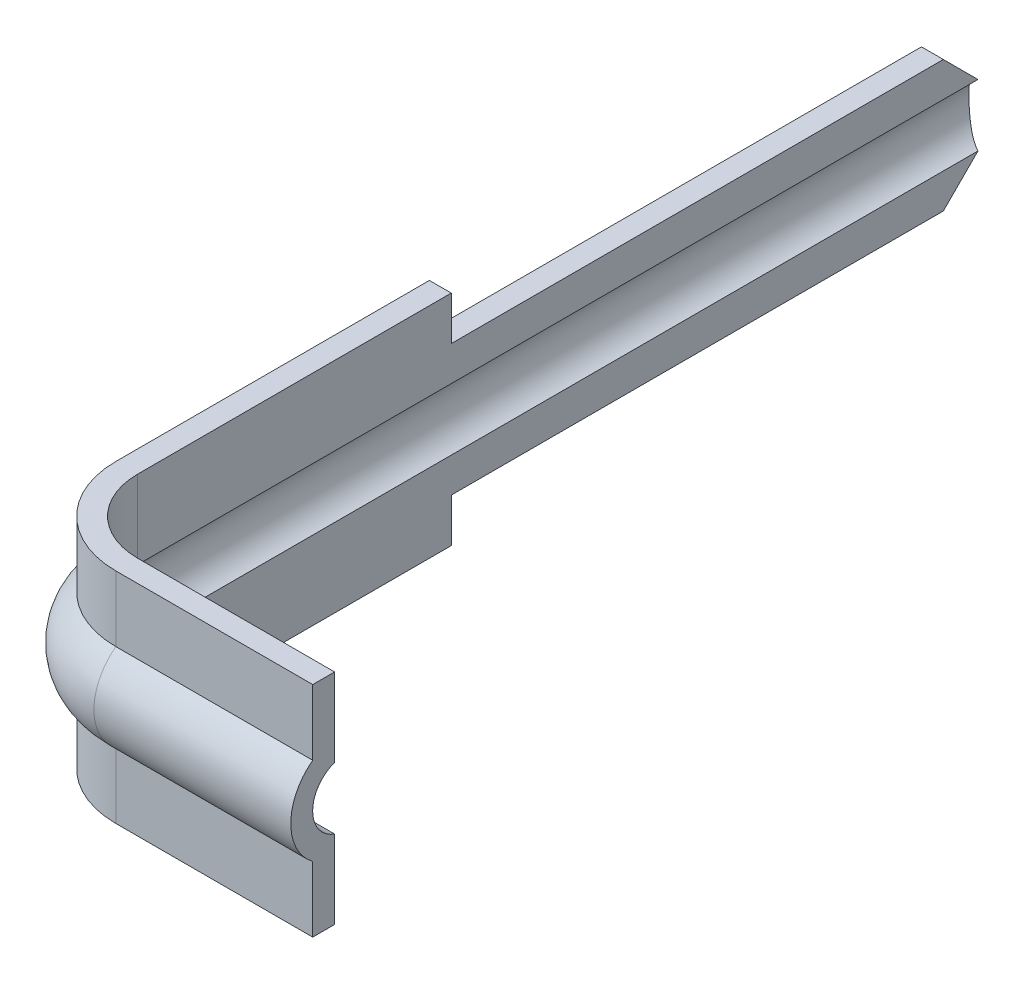
ISO-10303-21;
HEADER;
FILE_DESCRIPTION(('STEP AP214'),'2;1');
FILE_NAME('part.step','',(''),(''),'','','');
FILE_SCHEMA(('AUTOMOTIVE_DESIGN { 1 0 10303 214 1 1 1 1 }'));
ENDSEC;
DATA;
#1=APPLICATION_CONTEXT('core data for automotive mechanical design processes');
#2=APPLICATION_PROTOCOL_DEFINITION('international standard','automotive_design',2000,#1);
#3=PRODUCT_CONTEXT('',#1,'mechanical');
#4=PRODUCT('Part','Part','',(#3));
#5=PRODUCT_RELATED_PRODUCT_CATEGORY('part','',(#4));
#6=PRODUCT_DEFINITION_FORMATION('','',#4);
#7=PRODUCT_DEFINITION_CONTEXT('part definition',#1,'design');
#8=PRODUCT_DEFINITION('design','',#6,#7);
#9=PRODUCT_DEFINITION_SHAPE('','',#8);
#10=(LENGTH_UNIT() NAMED_UNIT(*) SI_UNIT(.MILLI.,.METRE.));
#11=(NAMED_UNIT(*) PLANE_ANGLE_UNIT() SI_UNIT($,.RADIAN.));
#12=(NAMED_UNIT(*) SI_UNIT($,.STERADIAN.) SOLID_ANGLE_UNIT());
#13=UNCERTAINTY_MEASURE_WITH_UNIT(LENGTH_MEASURE(1.E-05),#10,'distance_accuracy_value','');
#14=(GEOMETRIC_REPRESENTATION_CONTEXT(3) GLOBAL_UNCERTAINTY_ASSIGNED_CONTEXT((#13)) GLOBAL_UNIT_ASSIGNED_CONTEXT((#10,
#11,#12)) REPRESENTATION_CONTEXT('',''));
#15=CARTESIAN_POINT('',(0.,0.,0.));
#16=DIRECTION('',(0.,0.,1.));
#17=DIRECTION('',(1.,0.,0.));
#18=AXIS2_PLACEMENT_3D('',#15,#16,#17);
#19=CARTESIAN_POINT('',(0.65,0.,6.399749095762));
#20=DIRECTION('',(1.,0.,0.));
#21=DIRECTION('',(0.,0.,-1.));
#22=AXIS2_PLACEMENT_3D('',#19,#20,#21);
#23=CYLINDRICAL_SURFACE('',#22,0.375);
#24=DIRECTION('',(1.,0.,0.));
#25=VECTOR('',#24,1.);
#26=CARTESIAN_POINT('',(0.65,-0.300363239545,6.624263960147));
#27=LINE('',#26,#25);
#28=CARTESIAN_POINT('',(2.,-0.300363239545206,6.624263960147));
#29=VERTEX_POINT('',#28);
#30=CARTESIAN_POINT('',(0.65,-0.300363239545066,6.62426396014705));
#31=VERTEX_POINT('',#30);
#32=EDGE_CURVE('E137',#29,#31,#27,.F.);
#33=ORIENTED_EDGE('',*,*,#32,.F.);
#34=CARTESIAN_POINT('',(2.,0.,6.399749095762));
#35=DIRECTION('',(1.,0.,0.));
#36=DIRECTION('',(0.,0.,-1.));
#37=AXIS2_PLACEMENT_3D('',#34,#35,#36);
#38=CIRCLE('',#37,0.375);
#39=CARTESIAN_POINT('',(2.,0.300363239545158,6.624263960147));
#40=VERTEX_POINT('',#39);
#41=EDGE_CURVE('E21',#29,#40,#38,.F.);
#42=ORIENTED_EDGE('',*,*,#41,.T.);
#43=DIRECTION('',(1.,0.,0.));
#44=VECTOR('',#43,1.);
#45=CARTESIAN_POINT('',(0.65,0.300363239545,6.624263960147));
#46=LINE('',#45,#44);
#47=CARTESIAN_POINT('',(0.65,0.300363239545051,6.62426396014704));
#48=VERTEX_POINT('',#47);
#49=EDGE_CURVE('E139',#48,#40,#46,.T.);
#50=ORIENTED_EDGE('',*,*,#49,.F.);
#51=CARTESIAN_POINT('',(0.65,0.,6.399749095762));
#52=DIRECTION('',(1.,0.,0.));
#53=DIRECTION('',(0.,0.,-1.));
#54=AXIS2_PLACEMENT_3D('',#51,#52,#53);
#55=CIRCLE('',#54,0.375);
#56=EDGE_CURVE('E134',#48,#31,#55,.T.);
#57=ORIENTED_EDGE('',*,*,#56,.T.);
#58=EDGE_LOOP('',(#33,#42,#50,#57));
#59=FACE_BOUND('',#58,.T.);
#60=ADVANCED_FACE('F17',(#59),#23,.T.);
#61=CARTESIAN_POINT('',(0.650000000000002,0.,5.974263960147));
#62=DIRECTION('',(0.,1.,0.));
#63=DIRECTION('',(0.,0.,1.));
#64=AXIS2_PLACEMENT_3D('',#61,#62,#63);
#65=TOROIDAL_SURFACE('',#64,0.425485135615345,0.224999999999753);
#66=CARTESIAN_POINT('',(0.65,-0.21230293351,5.974263960147));
#67=DIRECTION('',(0.,1.,0.));
#68=DIRECTION('',(0.,0.,1.));
#69=AXIS2_PLACEMENT_3D('',#66,#67,#68);
#70=CIRCLE('',#69,0.499999996033);
#71=CARTESIAN_POINT('',(0.65,-0.212302933509976,6.47426395617999));
#72=VERTEX_POINT('',#71);
#73=CARTESIAN_POINT('',(0.15000000260008,-0.212302934478904,5.974263960147));
#74=VERTEX_POINT('',#73);
#75=EDGE_CURVE('E159',#72,#74,#70,.F.);
#76=ORIENTED_EDGE('',*,*,#75,.T.);
#77=CARTESIAN_POINT('',(0.224514864384999,0.,5.974263960147));
#78=DIRECTION('',(0.,0.,1.));
#79=DIRECTION('',(1.,0.,0.));
#80=AXIS2_PLACEMENT_3D('',#77,#78,#79);
#81=CIRCLE('',#80,0.225);
#82=CARTESIAN_POINT('',(0.149999999999682,0.212302932117223,5.974263960147));
#83=VERTEX_POINT('',#82);
#84=EDGE_CURVE('E193',#74,#83,#81,.F.);
#85=ORIENTED_EDGE('',*,*,#84,.T.);
#86=CARTESIAN_POINT('',(0.65,0.212302932117,5.974263960147));
#87=DIRECTION('',(0.,1.,0.));
#88=DIRECTION('',(0.,0.,1.));
#89=AXIS2_PLACEMENT_3D('',#86,#87,#88);
#90=CIRCLE('',#89,0.5);
#91=CARTESIAN_POINT('',(0.65,0.212302932117099,6.47426396014703));
#92=VERTEX_POINT('',#91);
#93=EDGE_CURVE('E198',#83,#92,#90,.T.);
#94=ORIENTED_EDGE('',*,*,#93,.T.);
#95=CARTESIAN_POINT('',(0.65,0.,6.399749095762));
#96=DIRECTION('',(1.,0.,0.));
#97=DIRECTION('',(0.,0.,-1.));
#98=AXIS2_PLACEMENT_3D('',#95,#96,#97);
#99=CIRCLE('',#98,0.225);
#100=EDGE_CURVE('E186',#92,#72,#99,.T.);
#101=ORIENTED_EDGE('',*,*,#100,.T.);
#102=EDGE_LOOP('',(#76,#85,#94,#101));
#103=FACE_BOUND('',#102,.T.);
#104=ADVANCED_FACE('F475',(#103),#65,.F.);
#105=CARTESIAN_POINT('',(0.65,0.,6.399749095762));
#106=DIRECTION('',(1.,0.,0.));
#107=DIRECTION('',(0.,0.,-1.));
#108=AXIS2_PLACEMENT_3D('',#105,#106,#107);
#109=CYLINDRICAL_SURFACE('',#108,0.225);
#110=DIRECTION('',(-1.,0.,0.));
#111=VECTOR('',#110,1.);
#112=CARTESIAN_POINT('',(0.65,-0.21230293351,6.47426395618));
#113=LINE('',#112,#111);
#114=CARTESIAN_POINT('',(2.,-0.212302933509947,6.47426395618));
#115=VERTEX_POINT('',#114);
#116=EDGE_CURVE('E179',#72,#115,#113,.F.);
#117=ORIENTED_EDGE('',*,*,#116,.F.);
#118=ORIENTED_EDGE('',*,*,#100,.F.);
#119=DIRECTION('',(-1.,0.,0.));
#120=VECTOR('',#119,1.);
#121=CARTESIAN_POINT('',(0.65,0.212302932117,6.474263960147));
#122=LINE('',#121,#120);
#123=CARTESIAN_POINT('',(2.,0.212302932117223,6.474263960147));
#124=VERTEX_POINT('',#123);
#125=EDGE_CURVE('E195',#124,#92,#122,.T.);
#126=ORIENTED_EDGE('',*,*,#125,.F.);
#127=CARTESIAN_POINT('',(2.,0.,6.399749095762));
#128=DIRECTION('',(1.,0.,0.));
#129=DIRECTION('',(0.,0.,-1.));
#130=AXIS2_PLACEMENT_3D('',#127,#128,#129);
#131=CIRCLE('',#130,0.225);
#132=EDGE_CURVE('E188',#115,#124,#131,.F.);
#133=ORIENTED_EDGE('',*,*,#132,.F.);
#134=EDGE_LOOP('',(#117,#118,#126,#133));
#135=FACE_BOUND('',#134,.T.);
#136=ADVANCED_FACE('F470',(#135),#109,.F.);
#137=CARTESIAN_POINT('',(0.224514864385,0.,0.));
#138=DIRECTION('',(0.,0.,1.));
#139=DIRECTION('',(1.,0.,0.));
#140=AXIS2_PLACEMENT_3D('',#137,#138,#139);
#141=CYLINDRICAL_SURFACE('',#140,0.225);
#142=ORIENTED_EDGE('',*,*,#84,.F.);
#143=DIRECTION('',(0.,0.,1.));
#144=VECTOR('',#143,1.);
#145=CARTESIAN_POINT('',(0.15000000123301,-0.212302935447808,0.212217486093047));
#146=LINE('',#145,#144);
#147=CARTESIAN_POINT('',(0.149878706829823,-0.212217516437203,0.212217486093047));
#148=VERTEX_POINT('',#147);
#149=EDGE_CURVE('E392',#148,#74,#146,.T.);
#150=ORIENTED_EDGE('',*,*,#149,.F.);
#151=CARTESIAN_POINT('',(0.149854531057934,0.212251818902621,0.212251886558882));
#152=CARTESIAN_POINT('',(0.137009872833372,0.207705948526972,0.207680473895742));
#153=CARTESIAN_POINT('',(0.124839235359186,0.20214062642089,0.202417834791372));
#154=CARTESIAN_POINT('',(0.101858196558429,0.189098899184247,0.191212930079771));
#155=CARTESIAN_POINT('',(0.0910513324542329,0.181617670906104,0.185268970473873));
#156=CARTESIAN_POINT('',(0.0709116779501815,0.164926276219742,0.173455854395994));
#157=CARTESIAN_POINT('',(0.0615737792867725,0.155722356485768,0.167586507013828));
#158=CARTESIAN_POINT('',(0.0445066488330214,0.135629283834086,0.156428309511392));
#159=CARTESIAN_POINT('',(0.0367748848776444,0.124742831525081,0.15113855195332));
#160=CARTESIAN_POINT('',(0.0245888606867424,0.103779791506947,0.142606903498528));
#161=CARTESIAN_POINT('',(0.019787953314767,0.0939856996557297,0.13916723484887));
#162=CARTESIAN_POINT('',(0.0115939740804189,0.0735562783870995,0.133227509892223));
#163=CARTESIAN_POINT('',(0.00819979692309744,0.0629216172745249,0.130726716039307));
#164=CARTESIAN_POINT('',(0.00299194705349419,0.0409913393325027,0.126868175821447));
#165=CARTESIAN_POINT('',(0.00118848377505597,0.0296919424761923,0.12551781496205));
#166=CARTESIAN_POINT('',(-0.000670971779713009,0.00687021780712604,0.12412535134443));
#167=CARTESIAN_POINT('',(-0.000727653770083491,-0.00465202021885717,0.124082732226319));
#168=CARTESIAN_POINT('',(0.000821695307690322,-0.0263015087161359,0.125243240037184));
#169=CARTESIAN_POINT('',(0.00225498435335123,-0.0364489499031219,0.12631694598688));
#170=CARTESIAN_POINT('',(0.00643922332999268,-0.0563121889376492,0.129425082353867));
#171=CARTESIAN_POINT('',(0.00919027079931914,-0.0660279547750986,0.131459583887535));
#172=CARTESIAN_POINT('',(0.0159780558423754,-0.0851064544130938,0.13641505698033));
#173=CARTESIAN_POINT('',(0.0200513306223396,-0.0944494816443028,0.139361093364397));
#174=CARTESIAN_POINT('',(0.0292957223225264,-0.112320339203326,0.145920879918083));
#175=CARTESIAN_POINT('',(0.0344674997572095,-0.120847674572672,0.149535031645922));
#176=CARTESIAN_POINT('',(0.046702211971752,-0.138346635000022,0.157864223749857));
#177=CARTESIAN_POINT('',(0.0539364513548188,-0.147158562953652,0.162662482201177));
#178=CARTESIAN_POINT('',(0.0695411380838534,-0.163511365804319,0.172558538969062));
#179=CARTESIAN_POINT('',(0.0779120996840653,-0.171051661932379,0.177656472263404));
#180=CARTESIAN_POINT('',(0.0961703590875287,-0.185184776837844,0.188071793329845));
#181=CARTESIAN_POINT('',(0.106114068995095,-0.191707404838909,0.193386711928983));
#182=CARTESIAN_POINT('',(0.127138437883396,-0.203185226595241,0.203411628211903));
#183=CARTESIAN_POINT('',(0.138219139192974,-0.208140361966553,0.208121603359648));
#184=CARTESIAN_POINT('',(0.149854533802602,-0.212251819868164,0.212251887567013));
#185=B_SPLINE_CURVE_WITH_KNOTS('',3,(#151,#152,#153,#154,#155,#156,#157,#158,#159,#160,#161,
#162,#163,#164,#165,#166,#167,#168,#169,#170,#171,#172,#173,#174,#175,#176,#177,#178,#179,#180,
#181,#182,#183,#184),.UNSPECIFIED.,.F.,.F.,(4,2,2,2,2,2,2,2,2,2,2,2,2,2,2,2,4),(0.,
0.0429654000817238,0.0860400441416619,0.128961418834472,0.171814603128912,0.205989054978089,
0.240136604164766,0.27450175515878,0.308853336949201,0.339623345820457,0.370395632589994,
0.4021032492694,0.433829985546777,0.47080297466866,0.507792746481156,0.546717356360889,
0.585643415883894),.UNSPECIFIED.);
#186=CARTESIAN_POINT('',(0.149878703882219,0.212217513609271,0.212217487525755));
#187=VERTEX_POINT('',#186);
#188=EDGE_CURVE('E121',#187,#148,#185,.T.);
#189=ORIENTED_EDGE('',*,*,#188,.F.);
#190=DIRECTION('',(0.,0.,1.));
#191=VECTOR('',#190,1.);
#192=CARTESIAN_POINT('',(0.149999999999999,0.212302932117445,5.974263960147));
#193=LINE('',#192,#191);
#194=EDGE_CURVE('E171',#83,#187,#193,.F.);
#195=ORIENTED_EDGE('',*,*,#194,.F.);
#196=EDGE_LOOP('',(#142,#150,#189,#195));
#197=FACE_BOUND('',#196,.T.);
#198=ADVANCED_FACE('F464',(#197),#141,.F.);
#199=CARTESIAN_POINT('',(0.65,0.212302932117,6.474263960147));
#200=DIRECTION('',(0.,0.,-1.));
#201=DIRECTION('',(-1.,0.,0.));
#202=AXIS2_PLACEMENT_3D('',#199,#200,#201);
#203=PLANE('',#202);
#204=DIRECTION('',(1.,0.,0.));
#205=VECTOR('',#204,1.);
#206=CARTESIAN_POINT('',(0.15,0.75,6.474263960147));
#207=LINE('',#206,#205);
#208=CARTESIAN_POINT('',(2.,0.75,6.474263960147));
#209=VERTEX_POINT('',#208);
#210=CARTESIAN_POINT('',(0.65,0.75,6.474263960147));
#211=VERTEX_POINT('',#210);
#212=EDGE_CURVE('E351',#209,#211,#207,.F.);
#213=ORIENTED_EDGE('',*,*,#212,.F.);
#214=DIRECTION('',(0.,1.,0.));
#215=VECTOR('',#214,1.);
#216=CARTESIAN_POINT('',(2.,0.,6.474263960147));
#217=LINE('',#216,#215);
#218=EDGE_CURVE('E361',#209,#124,#217,.F.);
#219=ORIENTED_EDGE('',*,*,#218,.T.);
#220=ORIENTED_EDGE('',*,*,#125,.T.);
#221=DIRECTION('',(0.,1.,0.));
#222=VECTOR('',#221,1.);
#223=CARTESIAN_POINT('',(0.65,0.,6.474263960147));
#224=LINE('',#223,#222);
#225=EDGE_CURVE('E201',#92,#211,#224,.T.);
#226=ORIENTED_EDGE('',*,*,#225,.T.);
#227=EDGE_LOOP('',(#213,#219,#220,#226));
#228=FACE_BOUND('',#227,.T.);
#229=ADVANCED_FACE('F469',(#228),#203,.T.);
#230=CARTESIAN_POINT('',(0.65,0.,5.974263960147));
#231=DIRECTION('',(0.,1.,0.));
#232=DIRECTION('',(0.,0.,1.));
#233=AXIS2_PLACEMENT_3D('',#230,#231,#232);
#234=CYLINDRICAL_SURFACE('',#233,0.5);
#235=ORIENTED_EDGE('',*,*,#93,.F.);
#236=DIRECTION('',(0.,1.,0.));
#237=VECTOR('',#236,1.);
#238=CARTESIAN_POINT('',(0.149999999999999,0.212302932117,5.974263960147));
#239=LINE('',#238,#237);
#240=CARTESIAN_POINT('',(0.149999999999999,0.75,5.974263960147));
#241=VERTEX_POINT('',#240);
#242=EDGE_CURVE('E412',#241,#83,#239,.F.);
#243=ORIENTED_EDGE('',*,*,#242,.F.);
#244=CARTESIAN_POINT('',(0.65,0.75,5.974263960147));
#245=DIRECTION('',(0.,1.,0.));
#246=DIRECTION('',(0.,0.,1.));
#247=AXIS2_PLACEMENT_3D('',#244,#245,#246);
#248=CIRCLE('',#247,0.5);
#249=EDGE_CURVE('E348',#211,#241,#248,.F.);
#250=ORIENTED_EDGE('',*,*,#249,.F.);
#251=ORIENTED_EDGE('',*,*,#225,.F.);
#252=EDGE_LOOP('',(#235,#243,#250,#251));
#253=FACE_BOUND('',#252,.T.);
#254=ADVANCED_FACE('F540',(#253),#234,.F.);
#255=CARTESIAN_POINT('',(0.65,0.75,6.624263960147));
#256=DIRECTION('',(0.,0.,1.));
#257=DIRECTION('',(1.,0.,0.));
#258=AXIS2_PLACEMENT_3D('',#255,#256,#257);
#259=PLANE('',#258);
#260=ORIENTED_EDGE('',*,*,#49,.T.);
#261=DIRECTION('',(0.,1.,0.));
#262=VECTOR('',#261,1.);
#263=CARTESIAN_POINT('',(2.,0.,6.624263960147));
#264=LINE('',#263,#262);
#265=CARTESIAN_POINT('',(2.,0.75,6.624263960147));
#266=VERTEX_POINT('',#265);
#267=EDGE_CURVE('E370',#40,#266,#264,.T.);
#268=ORIENTED_EDGE('',*,*,#267,.T.);
#269=DIRECTION('',(1.,0.,0.));
#270=VECTOR('',#269,1.);
#271=CARTESIAN_POINT('',(0.15,0.75,6.624263960147));
#272=LINE('',#271,#270);
#273=CARTESIAN_POINT('',(0.65,0.75,6.624263960147));
#274=VERTEX_POINT('',#273);
#275=EDGE_CURVE('E340',#274,#266,#272,.T.);
#276=ORIENTED_EDGE('',*,*,#275,.F.);
#277=DIRECTION('',(0.,1.,0.));
#278=VECTOR('',#277,1.);
#279=CARTESIAN_POINT('',(0.65,0.75,6.624263960147));
#280=LINE('',#279,#278);
#281=EDGE_CURVE('E404',#274,#48,#280,.F.);
#282=ORIENTED_EDGE('',*,*,#281,.T.);
#283=EDGE_LOOP('',(#260,#268,#276,#282));
#284=FACE_BOUND('',#283,.T.);
#285=ADVANCED_FACE('F426',(#284),#259,.T.);
#286=CARTESIAN_POINT('',(0.15,0.212302932117,0.));
#287=DIRECTION('',(1.,0.,0.));
#288=DIRECTION('',(0.,0.,-1.));
#289=AXIS2_PLACEMENT_3D('',#286,#287,#288);
#290=PLANE('',#289);
#291=DIRECTION('',(0.,0.,1.));
#292=VECTOR('',#291,1.);
#293=CARTESIAN_POINT('',(0.149999999848,0.450000000021,3.824264353828));
#294=LINE('',#293,#292);
#295=CARTESIAN_POINT('',(0.149999999873333,0.450000000021,3.824264353828));
#296=VERTEX_POINT('',#295);
#297=CARTESIAN_POINT('',(0.149999999924,0.450000000021,0.45));
#298=VERTEX_POINT('',#297);
#299=EDGE_CURVE('E321',#296,#298,#294,.F.);
#300=ORIENTED_EDGE('',*,*,#299,.F.);
#301=DIRECTION('',(0.,1.,0.));
#302=VECTOR('',#301,1.);
#303=CARTESIAN_POINT('',(0.149999999924,1.074371982483,3.824264353828));
#304=LINE('',#303,#302);
#305=CARTESIAN_POINT('',(0.149999999949333,0.75,3.824264353828));
#306=VERTEX_POINT('',#305);
#307=EDGE_CURVE('E327',#306,#296,#304,.F.);
#308=ORIENTED_EDGE('',*,*,#307,.F.);
#309=DIRECTION('',(0.,0.,1.));
#310=VECTOR('',#309,1.);
#311=CARTESIAN_POINT('',(0.15,0.75,0.));
#312=LINE('',#311,#310);
#313=EDGE_CURVE('E343',#241,#306,#312,.F.);
#314=ORIENTED_EDGE('',*,*,#313,.F.);
#315=ORIENTED_EDGE('',*,*,#242,.T.);
#316=ORIENTED_EDGE('',*,*,#194,.T.);
#317=DIRECTION('',(0.,0.707106781186547,0.707106781186548));
#318=VECTOR('',#317,1.);
#319=CARTESIAN_POINT('',(0.15,0.212217483247,0.212217483226));
#320=LINE('',#319,#318);
#321=EDGE_CURVE('E169',#187,#298,#320,.T.);
#322=ORIENTED_EDGE('',*,*,#321,.T.);
#323=EDGE_LOOP('',(#300,#308,#314,#315,#316,#322));
#324=FACE_BOUND('',#323,.T.);
#325=ADVANCED_FACE('F543',(#324),#290,.T.);
#326=CARTESIAN_POINT('',(0.65,-0.300363239545,6.624263960147));
#327=DIRECTION('',(0.,0.,1.));
#328=DIRECTION('',(1.,0.,0.));
#329=AXIS2_PLACEMENT_3D('',#326,#327,#328);
#330=PLANE('',#329);
#331=DIRECTION('',(1.,0.,0.));
#332=VECTOR('',#331,1.);
#333=CARTESIAN_POINT('',(0.,-0.75,6.624263960147));
#334=LINE('',#333,#332);
#335=CARTESIAN_POINT('',(2.,-0.75,6.624263960147));
#336=VERTEX_POINT('',#335);
#337=CARTESIAN_POINT('',(0.65,-0.75,6.624263960147));
#338=VERTEX_POINT('',#337);
#339=EDGE_CURVE('E288',#336,#338,#334,.F.);
#340=ORIENTED_EDGE('',*,*,#339,.F.);
#341=DIRECTION('',(0.,1.,0.));
#342=VECTOR('',#341,1.);
#343=CARTESIAN_POINT('',(2.,0.,6.624263960147));
#344=LINE('',#343,#342);
#345=EDGE_CURVE('E168',#336,#29,#344,.T.);
#346=ORIENTED_EDGE('',*,*,#345,.T.);
#347=ORIENTED_EDGE('',*,*,#32,.T.);
#348=DIRECTION('',(0.,1.,0.));
#349=VECTOR('',#348,1.);
#350=CARTESIAN_POINT('',(0.65,-0.300363239545,6.624263960147));
#351=LINE('',#350,#349);
#352=EDGE_CURVE('E149',#31,#338,#351,.F.);
#353=ORIENTED_EDGE('',*,*,#352,.T.);
#354=EDGE_LOOP('',(#340,#346,#347,#353));
#355=FACE_BOUND('',#354,.T.);
#356=ADVANCED_FACE('F167',(#355),#330,.T.);
#357=CARTESIAN_POINT('',(0.65,0.,5.974263960147));
#358=DIRECTION('',(0.,1.,0.));
#359=DIRECTION('',(0.,0.,1.));
#360=AXIS2_PLACEMENT_3D('',#357,#358,#359);
#361=CYLINDRICAL_SURFACE('',#360,0.499999996033);
#362=DIRECTION('',(0.,1.,0.));
#363=VECTOR('',#362,1.);
#364=CARTESIAN_POINT('',(0.150000003966999,-0.75,5.974263960147));
#365=LINE('',#364,#363);
#366=CARTESIAN_POINT('',(0.150000003852999,-0.75,5.974263960147));
#367=VERTEX_POINT('',#366);
#368=EDGE_CURVE('E354',#74,#367,#365,.F.);
#369=ORIENTED_EDGE('',*,*,#368,.F.);
#370=ORIENTED_EDGE('',*,*,#75,.F.);
#371=DIRECTION('',(0.,1.,0.));
#372=VECTOR('',#371,1.);
#373=CARTESIAN_POINT('',(0.65,-0.75,6.47426395618));
#374=LINE('',#373,#372);
#375=CARTESIAN_POINT('',(0.65,-0.75,6.47426395618));
#376=VERTEX_POINT('',#375);
#377=EDGE_CURVE('E183',#376,#72,#374,.T.);
#378=ORIENTED_EDGE('',*,*,#377,.F.);
#379=CARTESIAN_POINT('',(0.65,-0.75,5.974263960147));
#380=DIRECTION('',(0.,1.,0.));
#381=DIRECTION('',(0.,0.,1.));
#382=AXIS2_PLACEMENT_3D('',#379,#380,#381);
#383=CIRCLE('',#382,0.499999996033);
#384=EDGE_CURVE('E282',#367,#376,#383,.T.);
#385=ORIENTED_EDGE('',*,*,#384,.F.);
#386=EDGE_LOOP('',(#369,#370,#378,#385));
#387=FACE_BOUND('',#386,.T.);
#388=ADVANCED_FACE('F576',(#387),#361,.F.);
#389=CARTESIAN_POINT('',(0.65,-0.75,6.47426395618));
#390=DIRECTION('',(0.,0.,-1.));
#391=DIRECTION('',(-1.,0.,0.));
#392=AXIS2_PLACEMENT_3D('',#389,#390,#391);
#393=PLANE('',#392);
#394=DIRECTION('',(0.,1.,0.));
#395=VECTOR('',#394,1.);
#396=CARTESIAN_POINT('',(2.,0.,6.47426395618));
#397=LINE('',#396,#395);
#398=CARTESIAN_POINT('',(2.,-0.75,6.47426395618));
#399=VERTEX_POINT('',#398);
#400=EDGE_CURVE('E182',#115,#399,#397,.F.);
#401=ORIENTED_EDGE('',*,*,#400,.T.);
#402=DIRECTION('',(1.,0.,0.));
#403=VECTOR('',#402,1.);
#404=CARTESIAN_POINT('',(0.,-0.75,6.47426395618));
#405=LINE('',#404,#403);
#406=EDGE_CURVE('E278',#376,#399,#405,.T.);
#407=ORIENTED_EDGE('',*,*,#406,.F.);
#408=ORIENTED_EDGE('',*,*,#377,.T.);
#409=ORIENTED_EDGE('',*,*,#116,.T.);
#410=EDGE_LOOP('',(#401,#407,#408,#409));
#411=FACE_BOUND('',#410,.T.);
#412=ADVANCED_FACE('F530',(#411),#393,.T.);
#413=CARTESIAN_POINT('',(2.,0.,6.399749095762));
#414=DIRECTION('',(-1.,0.,0.));
#415=DIRECTION('',(0.,0.,1.));
#416=AXIS2_PLACEMENT_3D('',#413,#414,#415);
#417=PLANE('',#416);
#418=DIRECTION('',(0.,0.,1.));
#419=VECTOR('',#418,1.);
#420=CARTESIAN_POINT('',(2.,0.75,0.));
#421=LINE('',#420,#419);
#422=EDGE_CURVE('E337',#266,#209,#421,.F.);
#423=ORIENTED_EDGE('',*,*,#422,.F.);
#424=ORIENTED_EDGE('',*,*,#267,.F.);
#425=ORIENTED_EDGE('',*,*,#41,.F.);
#426=ORIENTED_EDGE('',*,*,#345,.F.);
#427=DIRECTION('',(0.,0.,-1.));
#428=VECTOR('',#427,1.);
#429=CARTESIAN_POINT('',(2.,-0.75,0.));
#430=LINE('',#429,#428);
#431=EDGE_CURVE('E281',#399,#336,#430,.F.);
#432=ORIENTED_EDGE('',*,*,#431,.F.);
#433=ORIENTED_EDGE('',*,*,#400,.F.);
#434=ORIENTED_EDGE('',*,*,#132,.T.);
#435=ORIENTED_EDGE('',*,*,#218,.F.);
#436=EDGE_LOOP('',(#423,#424,#425,#426,#432,#433,#434,#435));
#437=FACE_BOUND('',#436,.T.);
#438=ADVANCED_FACE('F429',(#437),#417,.F.);
#439=CARTESIAN_POINT('',(0.150000003967,-0.75,0.));
#440=DIRECTION('',(1.,0.,0.));
#441=DIRECTION('',(0.,0.,-1.));
#442=AXIS2_PLACEMENT_3D('',#439,#440,#441);
#443=PLANE('',#442);
#444=ORIENTED_EDGE('',*,*,#149,.T.);
#445=ORIENTED_EDGE('',*,*,#368,.T.);
#446=DIRECTION('',(0.,0.,-1.));
#447=VECTOR('',#446,1.);
#448=CARTESIAN_POINT('',(0.150000003739,-0.75,0.));
#449=LINE('',#448,#447);
#450=CARTESIAN_POINT('',(0.150000003827666,-0.75,3.824264353828));
#451=VERTEX_POINT('',#450);
#452=EDGE_CURVE('E285',#451,#367,#449,.F.);
#453=ORIENTED_EDGE('',*,*,#452,.F.);
#454=DIRECTION('',(0.,1.,0.));
#455=VECTOR('',#454,1.);
#456=CARTESIAN_POINT('',(0.150000003966999,-0.75,3.824264353828));
#457=LINE('',#456,#455);
#458=CARTESIAN_POINT('',(0.150000003897333,-0.449999999979,3.824264353828));
#459=VERTEX_POINT('',#458);
#460=EDGE_CURVE('E357',#451,#459,#457,.T.);
#461=ORIENTED_EDGE('',*,*,#460,.T.);
#462=DIRECTION('',(0.,0.,-1.));
#463=VECTOR('',#462,1.);
#464=CARTESIAN_POINT('',(0.150000003891,-0.449999999979,0.));
#465=LINE('',#464,#463);
#466=CARTESIAN_POINT('',(0.150000003929,-0.449999999979069,0.449999999999896));
#467=VERTEX_POINT('',#466);
#468=EDGE_CURVE('E298',#467,#459,#465,.F.);
#469=ORIENTED_EDGE('',*,*,#468,.F.);
#470=DIRECTION('',(0.,0.70710678118506,-0.707106781188034));
#471=VECTOR('',#470,1.);
#472=CARTESIAN_POINT('',(0.150000003967,-0.449999999979,0.45));
#473=LINE('',#472,#471);
#474=EDGE_CURVE('E360',#467,#148,#473,.T.);
#475=ORIENTED_EDGE('',*,*,#474,.T.);
#476=EDGE_LOOP('',(#444,#445,#453,#461,#469,#475));
#477=FACE_BOUND('',#476,.T.);
#478=ADVANCED_FACE('F497',(#477),#443,.T.);
#479=CARTESIAN_POINT('',(0.15,0.75,0.));
#480=DIRECTION('',(0.,1.,0.));
#481=DIRECTION('',(0.,0.,1.));
#482=AXIS2_PLACEMENT_3D('',#479,#480,#481);
#483=PLANE('',#482);
#484=ORIENTED_EDGE('',*,*,#275,.T.);
#485=ORIENTED_EDGE('',*,*,#422,.T.);
#486=ORIENTED_EDGE('',*,*,#212,.T.);
#487=ORIENTED_EDGE('',*,*,#249,.T.);
#488=ORIENTED_EDGE('',*,*,#313,.T.);
#489=DIRECTION('',(-1.,0.,0.));
#490=VECTOR('',#489,1.);
#491=CARTESIAN_POINT('',(0.149999999772,0.75,3.824264353828));
#492=LINE('',#491,#490);
#493=CARTESIAN_POINT('',(0.,0.75,3.824264353828));
#494=VERTEX_POINT('',#493);
#495=EDGE_CURVE('E334',#494,#306,#492,.F.);
#496=ORIENTED_EDGE('',*,*,#495,.F.);
#497=DIRECTION('',(0.,0.,1.));
#498=VECTOR('',#497,1.);
#499=CARTESIAN_POINT('',(0.,0.75,0.));
#500=LINE('',#499,#498);
#501=CARTESIAN_POINT('',(0.,0.75,5.974263960147));
#502=VERTEX_POINT('',#501);
#503=EDGE_CURVE('E256',#502,#494,#500,.F.);
#504=ORIENTED_EDGE('',*,*,#503,.F.);
#505=CARTESIAN_POINT('',(0.65,0.75,5.974263960147));
#506=DIRECTION('',(0.,1.,0.));
#507=DIRECTION('',(0.,0.,1.));
#508=AXIS2_PLACEMENT_3D('',#505,#506,#507);
#509=CIRCLE('',#508,0.65);
#510=EDGE_CURVE('E292',#274,#502,#509,.F.);
#511=ORIENTED_EDGE('',*,*,#510,.F.);
#512=EDGE_LOOP('',(#484,#485,#486,#487,#488,#496,#504,#511));
#513=FACE_BOUND('',#512,.T.);
#514=ADVANCED_FACE('F435',(#513),#483,.T.);
#515=CARTESIAN_POINT('',(0.149999999772,1.074371982483,3.824264353828));
#516=DIRECTION('',(0.,0.,-1.));
#517=DIRECTION('',(-1.,0.,0.));
#518=AXIS2_PLACEMENT_3D('',#515,#516,#517);
#519=PLANE('',#518);
#520=ORIENTED_EDGE('',*,*,#307,.T.);
#521=DIRECTION('',(1.,0.,0.));
#522=VECTOR('',#521,1.);
#523=CARTESIAN_POINT('',(0.149999999772,0.450000000021,3.824264353828));
#524=LINE('',#523,#522);
#525=CARTESIAN_POINT('',(0.,0.450000000021,3.824264353828));
#526=VERTEX_POINT('',#525);
#527=EDGE_CURVE('E324',#526,#296,#524,.T.);
#528=ORIENTED_EDGE('',*,*,#527,.F.);
#529=DIRECTION('',(0.,-1.,0.));
#530=VECTOR('',#529,1.);
#531=CARTESIAN_POINT('',(0.,0.75,3.824264353828));
#532=LINE('',#531,#530);
#533=EDGE_CURVE('E311',#494,#526,#532,.T.);
#534=ORIENTED_EDGE('',*,*,#533,.F.);
#535=ORIENTED_EDGE('',*,*,#495,.T.);
#536=EDGE_LOOP('',(#520,#528,#534,#535));
#537=FACE_BOUND('',#536,.T.);
#538=ADVANCED_FACE('F546',(#537),#519,.T.);
#539=CARTESIAN_POINT('',(0.149999999772,0.450000000021,3.824264353828));
#540=DIRECTION('',(0.,1.,0.));
#541=DIRECTION('',(0.,0.,1.));
#542=AXIS2_PLACEMENT_3D('',#539,#540,#541);
#543=PLANE('',#542);
#544=ORIENTED_EDGE('',*,*,#299,.T.);
#545=DIRECTION('',(1.,0.,0.));
#546=VECTOR('',#545,1.);
#547=CARTESIAN_POINT('',(0.149999999772,0.450000000021,0.45));
#548=LINE('',#547,#546);
#549=CARTESIAN_POINT('',(0.,0.450000000021,0.45));
#550=VERTEX_POINT('',#549);
#551=EDGE_CURVE('E318',#298,#550,#548,.F.);
#552=ORIENTED_EDGE('',*,*,#551,.T.);
#553=DIRECTION('',(0.,0.,1.));
#554=VECTOR('',#553,1.);
#555=CARTESIAN_POINT('',(0.,0.450000000021,0.));
#556=LINE('',#555,#554);
#557=EDGE_CURVE('E252',#526,#550,#556,.F.);
#558=ORIENTED_EDGE('',*,*,#557,.F.);
#559=ORIENTED_EDGE('',*,*,#527,.T.);
#560=EDGE_LOOP('',(#544,#552,#558,#559));
#561=FACE_BOUND('',#560,.T.);
#562=ADVANCED_FACE('F555',(#561),#543,.T.);
#563=CARTESIAN_POINT('',(0.65,0.,5.974263960147));
#564=DIRECTION('',(0.,1.,0.));
#565=DIRECTION('',(0.,0.,1.));
#566=AXIS2_PLACEMENT_3D('',#563,#564,#565);
#567=CYLINDRICAL_SURFACE('',#566,0.65);
#568=CARTESIAN_POINT('',(0.65,0.300363239545,5.974263960147));
#569=DIRECTION('',(0.,-1.,0.));
#570=DIRECTION('',(0.,0.,-1.));
#571=AXIS2_PLACEMENT_3D('',#568,#569,#570);
#572=CIRCLE('',#571,0.649999999999999);
#573=CARTESIAN_POINT('',(0.,0.300363239545152,5.974263960147));
#574=VERTEX_POINT('',#573);
#575=EDGE_CURVE('E164',#48,#574,#572,.T.);
#576=ORIENTED_EDGE('',*,*,#575,.F.);
#577=ORIENTED_EDGE('',*,*,#281,.F.);
#578=ORIENTED_EDGE('',*,*,#510,.T.);
#579=DIRECTION('',(0.,-1.,0.));
#580=VECTOR('',#579,1.);
#581=CARTESIAN_POINT('',(0.,0.75,5.974263960147));
#582=LINE('',#581,#580);
#583=EDGE_CURVE('E247',#574,#502,#582,.F.);
#584=ORIENTED_EDGE('',*,*,#583,.F.);
#585=EDGE_LOOP('',(#576,#577,#578,#584));
#586=FACE_BOUND('',#585,.T.);
#587=ADVANCED_FACE('F553',(#586),#567,.T.);
#588=CARTESIAN_POINT('',(0.,-0.75,0.));
#589=DIRECTION('',(0.,-1.,0.));
#590=DIRECTION('',(0.,0.,-1.));
#591=AXIS2_PLACEMENT_3D('',#588,#589,#590);
#592=PLANE('',#591);
#593=ORIENTED_EDGE('',*,*,#406,.T.);
#594=ORIENTED_EDGE('',*,*,#431,.T.);
#595=ORIENTED_EDGE('',*,*,#339,.T.);
#596=CARTESIAN_POINT('',(0.65,-0.75,5.974263960147));
#597=DIRECTION('',(0.,1.,0.));
#598=DIRECTION('',(0.,0.,1.));
#599=AXIS2_PLACEMENT_3D('',#596,#597,#598);
#600=CIRCLE('',#599,0.65);
#601=CARTESIAN_POINT('',(0.,-0.75,5.974263960147));
#602=VERTEX_POINT('',#601);
#603=EDGE_CURVE('E155',#602,#338,#600,.T.);
#604=ORIENTED_EDGE('',*,*,#603,.F.);
#605=DIRECTION('',(0.,0.,1.));
#606=VECTOR('',#605,1.);
#607=CARTESIAN_POINT('',(0.,-0.75,0.));
#608=LINE('',#607,#606);
#609=CARTESIAN_POINT('',(0.,-0.75,3.824264353828));
#610=VERTEX_POINT('',#609);
#611=EDGE_CURVE('E272',#610,#602,#608,.T.);
#612=ORIENTED_EDGE('',*,*,#611,.F.);
#613=DIRECTION('',(-1.,0.,0.));
#614=VECTOR('',#613,1.);
#615=CARTESIAN_POINT('',(0.150000003739,-0.75,3.824264353828));
#616=LINE('',#615,#614);
#617=EDGE_CURVE('E295',#451,#610,#616,.T.);
#618=ORIENTED_EDGE('',*,*,#617,.F.);
#619=ORIENTED_EDGE('',*,*,#452,.T.);
#620=ORIENTED_EDGE('',*,*,#384,.T.);
#621=EDGE_LOOP('',(#593,#594,#595,#604,#612,#618,#619,#620));
#622=FACE_BOUND('',#621,.T.);
#623=ADVANCED_FACE('F525',(#622),#592,.T.);
#624=CARTESIAN_POINT('',(0.65,0.,5.974263960147));
#625=DIRECTION('',(0.,1.,0.));
#626=DIRECTION('',(0.,0.,1.));
#627=AXIS2_PLACEMENT_3D('',#624,#625,#626);
#628=CYLINDRICAL_SURFACE('',#627,0.65);
#629=ORIENTED_EDGE('',*,*,#603,.T.);
#630=ORIENTED_EDGE('',*,*,#352,.F.);
#631=CARTESIAN_POINT('',(0.65,-0.300363239545,5.974263960147));
#632=DIRECTION('',(0.,1.,0.));
#633=DIRECTION('',(0.,0.,1.));
#634=AXIS2_PLACEMENT_3D('',#631,#632,#633);
#635=CIRCLE('',#634,0.649999999999999);
#636=CARTESIAN_POINT('',(0.,-0.300363239545198,5.974263960147));
#637=VERTEX_POINT('',#636);
#638=EDGE_CURVE('E153',#637,#31,#635,.T.);
#639=ORIENTED_EDGE('',*,*,#638,.F.);
#640=DIRECTION('',(0.,1.,0.));
#641=VECTOR('',#640,1.);
#642=CARTESIAN_POINT('',(0.,-0.300363239545,5.974263960147));
#643=LINE('',#642,#641);
#644=EDGE_CURVE('E275',#602,#637,#643,.T.);
#645=ORIENTED_EDGE('',*,*,#644,.F.);
#646=EDGE_LOOP('',(#629,#630,#639,#645));
#647=FACE_BOUND('',#646,.T.);
#648=ADVANCED_FACE('F150',(#647),#628,.T.);
#649=CARTESIAN_POINT('',(0.150000003739,-0.449999999979,0.));
#650=DIRECTION('',(0.,-1.,0.));
#651=DIRECTION('',(0.,0.,-1.));
#652=AXIS2_PLACEMENT_3D('',#649,#650,#651);
#653=PLANE('',#652);
#654=DIRECTION('',(0.,0.,1.));
#655=VECTOR('',#654,1.);
#656=CARTESIAN_POINT('',(0.,-0.449999999979,0.));
#657=LINE('',#656,#655);
#658=CARTESIAN_POINT('',(0.,-0.449999999979046,0.449999999999954));
#659=VERTEX_POINT('',#658);
#660=CARTESIAN_POINT('',(0.,-0.449999999979,3.824264353828));
#661=VERTEX_POINT('',#660);
#662=EDGE_CURVE('E266',#659,#661,#657,.T.);
#663=ORIENTED_EDGE('',*,*,#662,.F.);
#664=DIRECTION('',(1.,0.,0.));
#665=VECTOR('',#664,1.);
#666=CARTESIAN_POINT('',(0.224514864385,-0.449999999979138,0.449999999999862));
#667=LINE('',#666,#665);
#668=EDGE_CURVE('E244',#659,#467,#667,.T.);
#669=ORIENTED_EDGE('',*,*,#668,.T.);
#670=ORIENTED_EDGE('',*,*,#468,.T.);
#671=DIRECTION('',(-1.,0.,0.));
#672=VECTOR('',#671,1.);
#673=CARTESIAN_POINT('',(0.150000003739,-0.449999999979,3.824264353828));
#674=LINE('',#673,#672);
#675=EDGE_CURVE('E165',#661,#459,#674,.F.);
#676=ORIENTED_EDGE('',*,*,#675,.F.);
#677=EDGE_LOOP('',(#663,#669,#670,#676));
#678=FACE_BOUND('',#677,.T.);
#679=ADVANCED_FACE('F503',(#678),#653,.T.);
#680=CARTESIAN_POINT('',(0.150000003739,-0.449999999979,3.824264353828));
#681=DIRECTION('',(0.,0.,-1.));
#682=DIRECTION('',(-1.,0.,0.));
#683=AXIS2_PLACEMENT_3D('',#680,#681,#682);
#684=PLANE('',#683);
#685=DIRECTION('',(0.,1.,0.));
#686=VECTOR('',#685,1.);
#687=CARTESIAN_POINT('',(0.,-0.300363239545,3.824264353828));
#688=LINE('',#687,#686);
#689=EDGE_CURVE('E269',#661,#610,#688,.F.);
#690=ORIENTED_EDGE('',*,*,#689,.F.);
#691=ORIENTED_EDGE('',*,*,#675,.T.);
#692=ORIENTED_EDGE('',*,*,#460,.F.);
#693=ORIENTED_EDGE('',*,*,#617,.T.);
#694=EDGE_LOOP('',(#690,#691,#692,#693));
#695=FACE_BOUND('',#694,.T.);
#696=ADVANCED_FACE('F699',(#695),#684,.T.);
#697=CARTESIAN_POINT('',(0.65,0.,5.974263960147));
#698=DIRECTION('',(0.,1.,0.));
#699=DIRECTION('',(0.,0.,1.));
#700=AXIS2_PLACEMENT_3D('',#697,#698,#699);
#701=TOROIDAL_SURFACE('',#700,0.425485135615811,0.374999999999226);
#702=ORIENTED_EDGE('',*,*,#56,.F.);
#703=ORIENTED_EDGE('',*,*,#575,.T.);
#704=CARTESIAN_POINT('',(0.224514864384999,0.,5.974263960147));
#705=DIRECTION('',(0.,0.,1.));
#706=DIRECTION('',(1.,0.,0.));
#707=AXIS2_PLACEMENT_3D('',#704,#705,#706);
#708=CIRCLE('',#707,0.375);
#709=EDGE_CURVE('E162',#637,#574,#708,.F.);
#710=ORIENTED_EDGE('',*,*,#709,.F.);
#711=ORIENTED_EDGE('',*,*,#638,.T.);
#712=EDGE_LOOP('',(#702,#703,#710,#711));
#713=FACE_BOUND('',#712,.T.);
#714=ADVANCED_FACE('F19',(#713),#701,.T.);
#715=CARTESIAN_POINT('',(0.,0.75,0.));
#716=DIRECTION('',(-1.,0.,0.));
#717=DIRECTION('',(0.,-1.,0.));
#718=AXIS2_PLACEMENT_3D('',#715,#716,#717);
#719=PLANE('',#718);
#720=DIRECTION('',(0.,0.,1.));
#721=VECTOR('',#720,1.);
#722=CARTESIAN_POINT('',(-1.49592794748687E-13,0.300363239545203,0.));
#723=LINE('',#722,#721);
#724=CARTESIAN_POINT('',(0.,0.300363239545259,0.300363239524259));
#725=VERTEX_POINT('',#724);
#726=EDGE_CURVE('E552',#574,#725,#723,.F.);
#727=ORIENTED_EDGE('',*,*,#726,.F.);
#728=ORIENTED_EDGE('',*,*,#583,.T.);
#729=ORIENTED_EDGE('',*,*,#503,.T.);
#730=ORIENTED_EDGE('',*,*,#533,.T.);
#731=ORIENTED_EDGE('',*,*,#557,.T.);
#732=DIRECTION('',(0.,-0.707106781186548,-0.707106781186548));
#733=VECTOR('',#732,1.);
#734=CARTESIAN_POINT('',(0.,0.450000000021,0.45));
#735=LINE('',#734,#733);
#736=EDGE_CURVE('E245',#550,#725,#735,.T.);
#737=ORIENTED_EDGE('',*,*,#736,.T.);
#738=EDGE_LOOP('',(#727,#728,#729,#730,#731,#737));
#739=FACE_BOUND('',#738,.T.);
#740=ADVANCED_FACE('F550',(#739),#719,.T.);
#741=CARTESIAN_POINT('',(0.149999999772,0.450000000021,0.45));
#742=DIRECTION('',(0.,-0.707106781186548,0.707106781186548));
#743=DIRECTION('',(0.,-0.707106781186548,-0.707106781186548));
#744=AXIS2_PLACEMENT_3D('',#741,#742,#743);
#745=PLANE('',#744);
#746=ORIENTED_EDGE('',*,*,#736,.F.);
#747=ORIENTED_EDGE('',*,*,#551,.F.);
#748=ORIENTED_EDGE('',*,*,#321,.F.);
#749=CARTESIAN_POINT('',(-0.08471805752194,0.212132034376827,0.212132034356173));
#750=CARTESIAN_POINT('',(-0.0749482454492758,0.212135594746217,0.212135594725564));
#751=CARTESIAN_POINT('',(-0.0651784333766117,0.212139155025974,0.212139155184589));
#752=CARTESIAN_POINT('',(-0.0456388092312833,0.212146275406208,0.2121462762819));
#753=CARTESIAN_POINT('',(-0.0358689971586192,0.212149835506687,0.212149836920185));
#754=CARTESIAN_POINT('',(-0.0163293730132908,0.212156955528356,0.212156958376006));
#755=CARTESIAN_POINT('',(-0.00655956094062667,0.212160515449547,0.212160519193542));
#756=CARTESIAN_POINT('',(0.0129800632047017,0.212167635112634,0.212167641007856));
#757=CARTESIAN_POINT('',(0.0227498752773658,0.212171194854529,0.212171202004634));
#758=CARTESIAN_POINT('',(0.0422894994226942,0.212178314159015,0.212178324177423));
#759=CARTESIAN_POINT('',(0.0520593114953583,0.212181873721605,0.212181885353434));
#760=CARTESIAN_POINT('',(0.0715989356406867,0.212188992667471,0.21218900788468));
#761=CARTESIAN_POINT('',(0.0813687477133508,0.212192552050747,0.212192569239914));
#762=CARTESIAN_POINT('',(0.100908371858679,0.212199670637976,0.212199692129599));
#763=CARTESIAN_POINT('',(0.110678183931343,0.212203229841929,0.212203253664048));
#764=CARTESIAN_POINT('',(0.130217808076672,0.212210348070503,0.212210376912153));
#765=CARTESIAN_POINT('',(0.139987620149336,0.212213907095123,0.212213938625808));
#766=CARTESIAN_POINT('',(0.149757432222,0.212217466030074,0.212217500429062));
#767=B_SPLINE_CURVE_WITH_KNOTS('',3,(#749,#750,#751,#752,#753,#754,#755,#756,#757,#758,#759,
#760,#761,#762,#763,#764,#765,#766),.UNSPECIFIED.,.F.,.F.,(4,2,2,2,2,2,2,2,4),(0.,
0.0293094401104613,0.0586188802209225,0.0879283203313837,0.117237760441845,0.146547200552306,
0.175856640662767,0.205166080773229,0.23447552088369),.UNSPECIFIED.);
#768=CARTESIAN_POINT('',(-0.0847180575219562,0.212132034376832,0.212132034356179));
#769=VERTEX_POINT('',#768);
#770=EDGE_CURVE('E237',#769,#187,#767,.T.);
#771=ORIENTED_EDGE('',*,*,#770,.F.);
#772=CARTESIAN_POINT('',(0.224514864385,0.,-2.1048285377521E-11));
#773=DIRECTION('',(0.,-0.707106781186548,0.707106781186548));
#774=DIRECTION('',(0.,0.707106781186548,0.707106781186548));
#775=AXIS2_PLACEMENT_3D('',#772,#773,#774);
#776=ELLIPSE('',#775,0.530330085889911,0.375);
#777=EDGE_CURVE('E214',#725,#769,#776,.T.);
#778=ORIENTED_EDGE('',*,*,#777,.F.);
#779=EDGE_LOOP('',(#746,#747,#748,#771,#778));
#780=FACE_BOUND('',#779,.T.);
#781=ADVANCED_FACE('F225',(#780),#745,.F.);
#782=CARTESIAN_POINT('',(0.149999999772,2.072482268266E-11,0.424264068712));
#783=DIRECTION('',(-1.,0.,0.));
#784=DIRECTION('',(0.,0.,1.));
#785=AXIS2_PLACEMENT_3D('',#782,#783,#784);
#786=CYLINDRICAL_SURFACE('',#785,0.3);
#787=ORIENTED_EDGE('',*,*,#188,.T.);
#788=DIRECTION('',(-0.999999867191784,0.000364428604170927,-0.000364428604170927));
#789=VECTOR('',#788,1.);
#790=CARTESIAN_POINT('',(0.149757434147,-0.212217483922638,0.212217483943362));
#791=LINE('',#790,#789);
#792=CARTESIAN_POINT('',(-0.0847180575505829,-0.212132034335135,0.212132034355893));
#793=VERTEX_POINT('',#792);
#794=EDGE_CURVE('E263',#148,#793,#791,.T.);
#795=ORIENTED_EDGE('',*,*,#794,.T.);
#796=CARTESIAN_POINT('',(-0.0847180575219724,0.212132034376838,0.212132034356184));
#797=CARTESIAN_POINT('',(-0.0922319983032705,0.201199190962973,0.201199627164675));
#798=CARTESIAN_POINT('',(-0.0995268876093026,0.189299838788098,0.190992372318933));
#799=CARTESIAN_POINT('',(-0.113222164139079,0.163614918001509,0.172302633288068));
#800=CARTESIAN_POINT('',(-0.119615836500971,0.149816563703722,0.163832902332041));
#801=CARTESIAN_POINT('',(-0.130041274967068,0.122841979749177,0.150219662585526));
#802=CARTESIAN_POINT('',(-0.134286365930376,0.109909279982271,0.144762512788332));
#803=CARTESIAN_POINT('',(-0.141422908840188,0.0831020691179752,0.135657692865282));
#804=CARTESIAN_POINT('',(-0.144318316734334,0.0692304486467968,0.132004732726155));
#805=CARTESIAN_POINT('',(-0.148540618025522,0.0407750816780894,0.126693947271327));
#806=CARTESIAN_POINT('',(-0.149857245474178,0.0261873095793976,0.12504917888605));
#807=CARTESIAN_POINT('',(-0.150758619145696,-0.00313336820435057,0.123922025700479));
#808=CARTESIAN_POINT('',(-0.150342778446458,-0.0178663213869522,0.124440373716539));
#809=CARTESIAN_POINT('',(-0.147941569167624,-0.0455646775460028,0.12744854762391));
#810=CARTESIAN_POINT('',(-0.146108742434127,-0.0585652302861428,0.129746802140051));
#811=CARTESIAN_POINT('',(-0.1412011409907,-0.0839267888555746,0.135946860948549));
#812=CARTESIAN_POINT('',(-0.138126353457381,-0.0962877880799153,0.139848681797923));
#813=CARTESIAN_POINT('',(-0.130737799122194,-0.120804067829598,0.149330155850917));
#814=CARTESIAN_POINT('',(-0.126364585019135,-0.132909582919035,0.154991125193717));
#815=CARTESIAN_POINT('',(-0.11672832075277,-0.155995693666251,0.167672256016157));
#816=CARTESIAN_POINT('',(-0.111464706265287,-0.166975568775674,0.174693279892796));
#817=CARTESIAN_POINT('',(-0.0992025116359511,-0.189823844725212,0.191444374387238));
#818=CARTESIAN_POINT('',(-0.0920675211874351,-0.201430394460378,0.201435403081371));
#819=CARTESIAN_POINT('',(-0.0847180575507506,-0.212132034336402,0.212132034354366));
#820=B_SPLINE_CURVE_WITH_KNOTS('',3,(#796,#797,#798,#799,#800,#801,#802,#803,#804,#805,#806,
#807,#808,#809,#810,#811,#812,#813,#814,#815,#816,#817,#818,#819),.UNSPECIFIED.,.F.,.F.,(4,2,2,
2,2,2,2,2,2,2,2,4),(0.,0.0516206501524925,0.103607608400631,0.147417389781763,0.191097943669299,
0.235061014326492,0.279038979915845,0.31884747616596,0.358656383453944,0.400681565814518,
0.4427334836711,0.49320011977548),.UNSPECIFIED.);
#821=EDGE_CURVE('E206',#769,#793,#820,.T.);
#822=ORIENTED_EDGE('',*,*,#821,.F.);
#823=ORIENTED_EDGE('',*,*,#770,.T.);
#824=EDGE_LOOP('',(#787,#795,#822,#823));
#825=FACE_BOUND('',#824,.T.);
#826=ADVANCED_FACE('F219',(#825),#786,.T.);
#827=CARTESIAN_POINT('',(0.224514864385,2.072387400576E-11,0.));
#828=DIRECTION('',(0.,0.707106781186548,0.707106781186548));
#829=DIRECTION('',(0.,-0.707106781186548,0.707106781186548));
#830=AXIS2_PLACEMENT_3D('',#827,#828,#829);
#831=PLANE('',#830);
#832=ORIENTED_EDGE('',*,*,#474,.F.);
#833=ORIENTED_EDGE('',*,*,#668,.F.);
#834=DIRECTION('',(0.,-0.707106781186547,0.707106781186548));
#835=VECTOR('',#834,1.);
#836=CARTESIAN_POINT('',(0.,-0.300363239545,0.300363239566));
#837=LINE('',#836,#835);
#838=CARTESIAN_POINT('',(0.,-0.30036323954527,0.300363239566132));
#839=VERTEX_POINT('',#838);
#840=EDGE_CURVE('E36',#839,#659,#837,.T.);
#841=ORIENTED_EDGE('',*,*,#840,.F.);
#842=CARTESIAN_POINT('',(0.224514864385,0.,2.07722294226528E-11));
#843=DIRECTION('',(0.,0.707106781186548,0.707106781186548));
#844=DIRECTION('',(0.,-0.707106781186548,0.707106781186548));
#845=AXIS2_PLACEMENT_3D('',#842,#843,#844);
#846=ELLIPSE('',#845,0.530330085889911,0.375);
#847=EDGE_CURVE('E27',#793,#839,#846,.T.);
#848=ORIENTED_EDGE('',*,*,#847,.F.);
#849=ORIENTED_EDGE('',*,*,#794,.F.);
#850=EDGE_LOOP('',(#832,#833,#841,#848,#849));
#851=FACE_BOUND('',#850,.T.);
#852=ADVANCED_FACE('F224',(#851),#831,.F.);
#853=CARTESIAN_POINT('',(0.,-0.300363239545,0.));
#854=DIRECTION('',(-1.,0.,0.));
#855=DIRECTION('',(0.,0.,1.));
#856=AXIS2_PLACEMENT_3D('',#853,#854,#855);
#857=PLANE('',#856);
#858=ORIENTED_EDGE('',*,*,#662,.T.);
#859=ORIENTED_EDGE('',*,*,#689,.T.);
#860=ORIENTED_EDGE('',*,*,#611,.T.);
#861=ORIENTED_EDGE('',*,*,#644,.T.);
#862=DIRECTION('',(0.,0.,1.));
#863=VECTOR('',#862,1.);
#864=CARTESIAN_POINT('',(-1.95806912350882E-13,-0.300363239545265,0.));
#865=LINE('',#864,#863);
#866=EDGE_CURVE('E11',#839,#637,#865,.T.);
#867=ORIENTED_EDGE('',*,*,#866,.F.);
#868=ORIENTED_EDGE('',*,*,#840,.T.);
#869=EDGE_LOOP('',(#858,#859,#860,#861,#867,#868));
#870=FACE_BOUND('',#869,.T.);
#871=ADVANCED_FACE('F484',(#870),#857,.T.);
#872=CARTESIAN_POINT('',(0.224514864385,0.,0.));
#873=DIRECTION('',(0.,0.,1.));
#874=DIRECTION('',(1.,0.,0.));
#875=AXIS2_PLACEMENT_3D('',#872,#873,#874);
#876=CYLINDRICAL_SURFACE('',#875,0.375);
#877=ORIENTED_EDGE('',*,*,#847,.T.);
#878=ORIENTED_EDGE('',*,*,#866,.T.);
#879=ORIENTED_EDGE('',*,*,#709,.T.);
#880=ORIENTED_EDGE('',*,*,#726,.T.);
#881=ORIENTED_EDGE('',*,*,#777,.T.);
#882=ORIENTED_EDGE('',*,*,#821,.T.);
#883=EDGE_LOOP('',(#877,#878,#879,#880,#881,#882));
#884=FACE_BOUND('',#883,.T.);
#885=ADVANCED_FACE('F216',(#884),#876,.T.);
#886=CLOSED_SHELL('',(#60,#104,#136,#198,#229,#254,#285,#325,#356,#388,#412,#438,#478,#514,#538,
#562,#587,#623,#648,#679,#696,#714,#740,#781,#826,#852,#871,#885));
#887=MANIFOLD_SOLID_BREP('B1',#886);
#888=ADVANCED_BREP_SHAPE_REPRESENTATION('',(#18,#887),#14);
#889=SHAPE_DEFINITION_REPRESENTATION(#9,#888);
ENDSEC;
END-ISO-10303-21;
